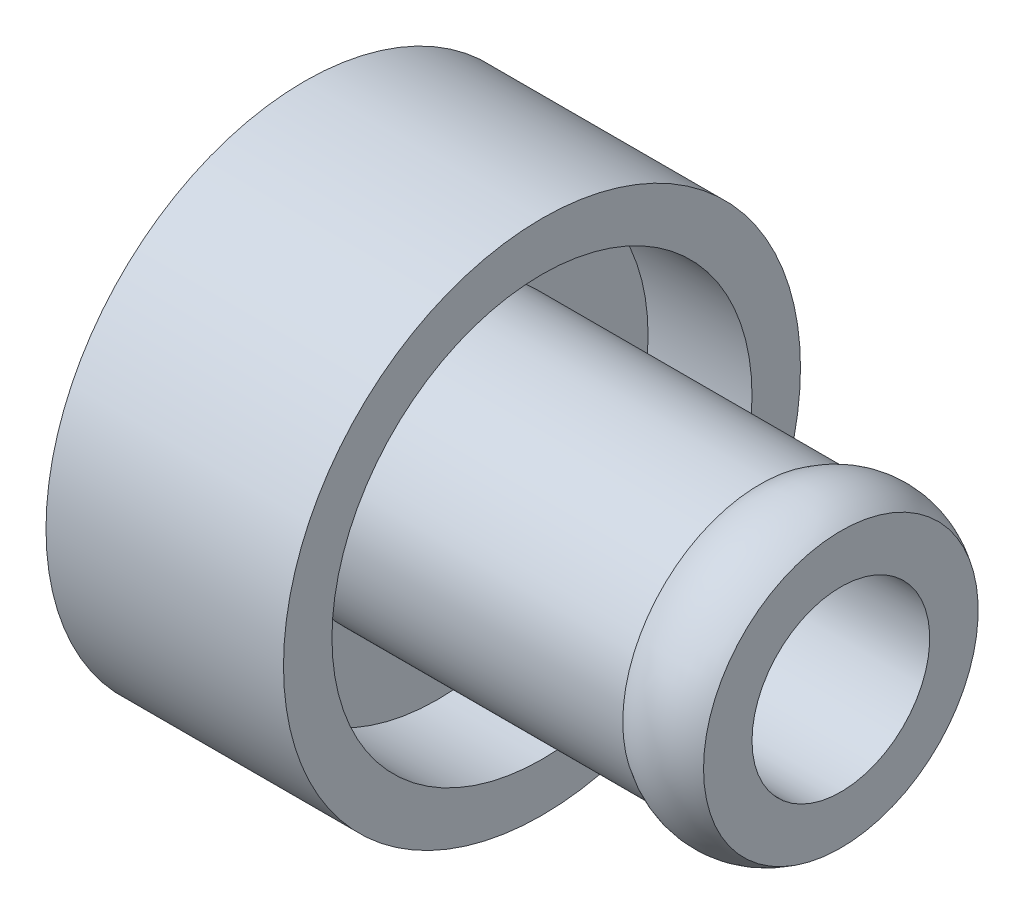
ISO-10303-21;
HEADER;
FILE_DESCRIPTION(('STEP AP214'),'2;1');
FILE_NAME('part.step','',(''),(''),'','','');
FILE_SCHEMA(('AUTOMOTIVE_DESIGN { 1 0 10303 214 1 1 1 1 }'));
ENDSEC;
DATA;
#1=APPLICATION_CONTEXT('core data for automotive mechanical design processes');
#2=APPLICATION_PROTOCOL_DEFINITION('international standard','automotive_design',2000,#1);
#3=PRODUCT_CONTEXT('',#1,'mechanical');
#4=PRODUCT('Part','Part','',(#3));
#5=PRODUCT_RELATED_PRODUCT_CATEGORY('part','',(#4));
#6=PRODUCT_DEFINITION_FORMATION('','',#4);
#7=PRODUCT_DEFINITION_CONTEXT('part definition',#1,'design');
#8=PRODUCT_DEFINITION('design','',#6,#7);
#9=PRODUCT_DEFINITION_SHAPE('','',#8);
#10=(LENGTH_UNIT() NAMED_UNIT(*) SI_UNIT(.MILLI.,.METRE.));
#11=(NAMED_UNIT(*) PLANE_ANGLE_UNIT() SI_UNIT($,.RADIAN.));
#12=(NAMED_UNIT(*) SI_UNIT($,.STERADIAN.) SOLID_ANGLE_UNIT());
#13=UNCERTAINTY_MEASURE_WITH_UNIT(LENGTH_MEASURE(1.E-05),#10,'distance_accuracy_value','');
#14=(GEOMETRIC_REPRESENTATION_CONTEXT(3) GLOBAL_UNCERTAINTY_ASSIGNED_CONTEXT((#13)) GLOBAL_UNIT_ASSIGNED_CONTEXT((#10,
#11,#12)) REPRESENTATION_CONTEXT('',''));
#15=CARTESIAN_POINT('',(0.,0.,0.));
#16=DIRECTION('',(0.,0.,1.));
#17=DIRECTION('',(1.,0.,0.));
#18=AXIS2_PLACEMENT_3D('',#15,#16,#17);
#19=CARTESIAN_POINT('',(0.,0.,0.));
#20=DIRECTION('',(-1.,0.,0.));
#21=DIRECTION('',(0.,0.,1.));
#22=AXIS2_PLACEMENT_3D('',#19,#20,#21);
#23=CYLINDRICAL_SURFACE('',#22,2.159);
#24=CARTESIAN_POINT('',(2.09995516739447,0.,0.));
#25=DIRECTION('',(-1.,0.,0.));
#26=DIRECTION('',(0.,0.,1.));
#27=AXIS2_PLACEMENT_3D('',#24,#25,#26);
#28=CIRCLE('',#27,2.159);
#29=CARTESIAN_POINT('',(2.09995516739447,0.,2.159));
#30=VERTEX_POINT('',#29);
#31=EDGE_CURVE('E94',#30,#30,#28,.T.);
#32=ORIENTED_EDGE('',*,*,#31,.F.);
#33=EDGE_LOOP('',(#32));
#34=FACE_BOUND('',#33,.T.);
#35=CARTESIAN_POINT('',(7.1628,0.,0.));
#36=DIRECTION('',(1.,0.,0.));
#37=DIRECTION('',(0.,0.,-1.));
#38=AXIS2_PLACEMENT_3D('',#35,#36,#37);
#39=CIRCLE('',#38,2.159);
#40=CARTESIAN_POINT('',(7.1628,0.,-2.159));
#41=VERTEX_POINT('',#40);
#42=EDGE_CURVE('E12',#41,#41,#39,.T.);
#43=ORIENTED_EDGE('',*,*,#42,.F.);
#44=EDGE_LOOP('',(#43));
#45=FACE_BOUND('',#44,.T.);
#46=ADVANCED_FACE('F50',(#34,#45),#23,.T.);
#47=CARTESIAN_POINT('',(0.,0.,0.));
#48=DIRECTION('',(1.,0.,0.));
#49=DIRECTION('',(0.,0.,-1.));
#50=AXIS2_PLACEMENT_3D('',#47,#48,#49);
#51=PLANE('',#50);
#52=CARTESIAN_POINT('',(0.,0.,0.));
#53=DIRECTION('',(-1.,0.,0.));
#54=DIRECTION('',(0.,0.,1.));
#55=AXIS2_PLACEMENT_3D('',#52,#53,#54);
#56=CIRCLE('',#55,1.397);
#57=CARTESIAN_POINT('',(0.,0.,1.397));
#58=VERTEX_POINT('',#57);
#59=EDGE_CURVE('E103',#58,#58,#56,.T.);
#60=ORIENTED_EDGE('',*,*,#59,.F.);
#61=EDGE_LOOP('',(#60));
#62=FACE_BOUND('',#61,.T.);
#63=CARTESIAN_POINT('',(0.,0.,0.));
#64=DIRECTION('',(-1.,0.,0.));
#65=DIRECTION('',(0.,0.,1.));
#66=AXIS2_PLACEMENT_3D('',#63,#64,#65);
#67=CIRCLE('',#66,2.159);
#68=CARTESIAN_POINT('',(0.,0.,2.159));
#69=VERTEX_POINT('',#68);
#70=EDGE_CURVE('E58',#69,#69,#67,.T.);
#71=ORIENTED_EDGE('',*,*,#70,.T.);
#72=EDGE_LOOP('',(#71));
#73=FACE_BOUND('',#72,.T.);
#74=ADVANCED_FACE('F52',(#62,#73),#51,.F.);
#75=CARTESIAN_POINT('',(0.,0.,0.));
#76=DIRECTION('',(-1.,0.,0.));
#77=DIRECTION('',(0.,0.,1.));
#78=AXIS2_PLACEMENT_3D('',#75,#76,#77);
#79=CYLINDRICAL_SURFACE('',#78,2.159);
#80=ORIENTED_EDGE('',*,*,#70,.F.);
#81=EDGE_LOOP('',(#80));
#82=FACE_BOUND('',#81,.T.);
#83=CARTESIAN_POINT('',(1.33795516739447,0.,0.));
#84=DIRECTION('',(-1.,0.,0.));
#85=DIRECTION('',(0.,0.,1.));
#86=AXIS2_PLACEMENT_3D('',#83,#84,#85);
#87=CIRCLE('',#86,2.159);
#88=CARTESIAN_POINT('',(1.33795516739447,0.,2.159));
#89=VERTEX_POINT('',#88);
#90=EDGE_CURVE('E63',#89,#89,#87,.T.);
#91=ORIENTED_EDGE('',*,*,#90,.T.);
#92=EDGE_LOOP('',(#91));
#93=FACE_BOUND('',#92,.T.);
#94=ADVANCED_FACE('F122',(#82,#93),#79,.T.);
#95=CARTESIAN_POINT('',(1.33795516739447,2.159,0.));
#96=DIRECTION('',(1.,0.,0.));
#97=DIRECTION('',(0.,0.,-1.));
#98=AXIS2_PLACEMENT_3D('',#95,#96,#97);
#99=PLANE('',#98);
#100=ORIENTED_EDGE('',*,*,#90,.F.);
#101=EDGE_LOOP('',(#100));
#102=FACE_BOUND('',#101,.T.);
#103=CARTESIAN_POINT('',(1.33795516739447,0.,0.));
#104=DIRECTION('',(-1.,0.,0.));
#105=DIRECTION('',(0.,0.,1.));
#106=AXIS2_PLACEMENT_3D('',#103,#104,#105);
#107=CIRCLE('',#106,3.302);
#108=CARTESIAN_POINT('',(1.33795516739447,0.,3.302));
#109=VERTEX_POINT('',#108);
#110=EDGE_CURVE('E68',#109,#109,#107,.T.);
#111=ORIENTED_EDGE('',*,*,#110,.T.);
#112=EDGE_LOOP('',(#111));
#113=FACE_BOUND('',#112,.T.);
#114=ADVANCED_FACE('F127',(#102,#113),#99,.F.);
#115=CARTESIAN_POINT('',(0.,0.,0.));
#116=DIRECTION('',(-1.,0.,0.));
#117=DIRECTION('',(0.,0.,1.));
#118=AXIS2_PLACEMENT_3D('',#115,#116,#117);
#119=CYLINDRICAL_SURFACE('',#118,3.302);
#120=ORIENTED_EDGE('',*,*,#110,.F.);
#121=EDGE_LOOP('',(#120));
#122=FACE_BOUND('',#121,.T.);
#123=CARTESIAN_POINT('',(0.,0.,0.));
#124=DIRECTION('',(-1.,0.,0.));
#125=DIRECTION('',(0.,0.,1.));
#126=AXIS2_PLACEMENT_3D('',#123,#124,#125);
#127=CIRCLE('',#126,3.302);
#128=CARTESIAN_POINT('',(0.,0.,3.302));
#129=VERTEX_POINT('',#128);
#130=EDGE_CURVE('E74',#129,#129,#127,.T.);
#131=ORIENTED_EDGE('',*,*,#130,.T.);
#132=EDGE_LOOP('',(#131));
#133=FACE_BOUND('',#132,.T.);
#134=ADVANCED_FACE('F156',(#122,#133),#119,.F.);
#135=CARTESIAN_POINT('',(0.,3.302,0.));
#136=DIRECTION('',(1.,0.,0.));
#137=DIRECTION('',(0.,0.,-1.));
#138=AXIS2_PLACEMENT_3D('',#135,#136,#137);
#139=PLANE('',#138);
#140=ORIENTED_EDGE('',*,*,#130,.F.);
#141=EDGE_LOOP('',(#140));
#142=FACE_BOUND('',#141,.T.);
#143=CARTESIAN_POINT('',(0.,0.,0.));
#144=DIRECTION('',(-1.,0.,0.));
#145=DIRECTION('',(0.,0.,1.));
#146=AXIS2_PLACEMENT_3D('',#143,#144,#145);
#147=CIRCLE('',#146,4.064);
#148=CARTESIAN_POINT('',(0.,0.,4.064));
#149=VERTEX_POINT('',#148);
#150=EDGE_CURVE('E78',#149,#149,#147,.T.);
#151=ORIENTED_EDGE('',*,*,#150,.T.);
#152=EDGE_LOOP('',(#151));
#153=FACE_BOUND('',#152,.T.);
#154=ADVANCED_FACE('F152',(#142,#153),#139,.F.);
#155=CARTESIAN_POINT('',(0.,0.,0.));
#156=DIRECTION('',(-1.,0.,0.));
#157=DIRECTION('',(0.,0.,1.));
#158=AXIS2_PLACEMENT_3D('',#155,#156,#157);
#159=CYLINDRICAL_SURFACE('',#158,4.064);
#160=ORIENTED_EDGE('',*,*,#150,.F.);
#161=EDGE_LOOP('',(#160));
#162=FACE_BOUND('',#161,.T.);
#163=CARTESIAN_POINT('',(3.7338,0.,0.));
#164=DIRECTION('',(-1.,0.,0.));
#165=DIRECTION('',(0.,0.,1.));
#166=AXIS2_PLACEMENT_3D('',#163,#164,#165);
#167=CIRCLE('',#166,4.064);
#168=CARTESIAN_POINT('',(3.7338,0.,4.064));
#169=VERTEX_POINT('',#168);
#170=EDGE_CURVE('E82',#169,#169,#167,.T.);
#171=ORIENTED_EDGE('',*,*,#170,.T.);
#172=EDGE_LOOP('',(#171));
#173=FACE_BOUND('',#172,.T.);
#174=ADVANCED_FACE('F148',(#162,#173),#159,.T.);
#175=CARTESIAN_POINT('',(3.7338,4.064,0.));
#176=DIRECTION('',(-1.,0.,0.));
#177=DIRECTION('',(0.,0.,1.));
#178=AXIS2_PLACEMENT_3D('',#175,#176,#177);
#179=PLANE('',#178);
#180=ORIENTED_EDGE('',*,*,#170,.F.);
#181=EDGE_LOOP('',(#180));
#182=FACE_BOUND('',#181,.T.);
#183=CARTESIAN_POINT('',(3.7338,0.,0.));
#184=DIRECTION('',(-1.,0.,0.));
#185=DIRECTION('',(0.,0.,1.));
#186=AXIS2_PLACEMENT_3D('',#183,#184,#185);
#187=CIRCLE('',#186,3.302);
#188=CARTESIAN_POINT('',(3.7338,0.,3.302));
#189=VERTEX_POINT('',#188);
#190=EDGE_CURVE('E86',#189,#189,#187,.T.);
#191=ORIENTED_EDGE('',*,*,#190,.T.);
#192=EDGE_LOOP('',(#191));
#193=FACE_BOUND('',#192,.T.);
#194=ADVANCED_FACE('F144',(#182,#193),#179,.F.);
#195=CARTESIAN_POINT('',(0.,0.,0.));
#196=DIRECTION('',(-1.,0.,0.));
#197=DIRECTION('',(0.,0.,1.));
#198=AXIS2_PLACEMENT_3D('',#195,#196,#197);
#199=CYLINDRICAL_SURFACE('',#198,3.302);
#200=ORIENTED_EDGE('',*,*,#190,.F.);
#201=EDGE_LOOP('',(#200));
#202=FACE_BOUND('',#201,.T.);
#203=CARTESIAN_POINT('',(2.09995516739447,0.,0.));
#204=DIRECTION('',(-1.,0.,0.));
#205=DIRECTION('',(0.,0.,1.));
#206=AXIS2_PLACEMENT_3D('',#203,#204,#205);
#207=CIRCLE('',#206,3.302);
#208=CARTESIAN_POINT('',(2.09995516739447,0.,3.302));
#209=VERTEX_POINT('',#208);
#210=EDGE_CURVE('E90',#209,#209,#207,.T.);
#211=ORIENTED_EDGE('',*,*,#210,.T.);
#212=EDGE_LOOP('',(#211));
#213=FACE_BOUND('',#212,.T.);
#214=ADVANCED_FACE('F140',(#202,#213),#199,.F.);
#215=CARTESIAN_POINT('',(2.09995516739447,3.302,0.));
#216=DIRECTION('',(-1.,0.,0.));
#217=DIRECTION('',(0.,0.,1.));
#218=AXIS2_PLACEMENT_3D('',#215,#216,#217);
#219=PLANE('',#218);
#220=ORIENTED_EDGE('',*,*,#210,.F.);
#221=EDGE_LOOP('',(#220));
#222=FACE_BOUND('',#221,.T.);
#223=ORIENTED_EDGE('',*,*,#31,.T.);
#224=EDGE_LOOP('',(#223));
#225=FACE_BOUND('',#224,.T.);
#226=ADVANCED_FACE('F137',(#222,#225),#219,.F.);
#227=CARTESIAN_POINT('',(8.4328,2.159,0.));
#228=DIRECTION('',(-1.,0.,0.));
#229=DIRECTION('',(0.,0.,1.));
#230=AXIS2_PLACEMENT_3D('',#227,#228,#229);
#231=PLANE('',#230);
#232=CARTESIAN_POINT('',(8.4328,0.,0.));
#233=DIRECTION('',(-1.,0.,0.));
#234=DIRECTION('',(0.,0.,1.));
#235=AXIS2_PLACEMENT_3D('',#232,#233,#234);
#236=CIRCLE('',#235,1.397);
#237=CARTESIAN_POINT('',(8.4328,0.,1.397));
#238=VERTEX_POINT('',#237);
#239=EDGE_CURVE('E102',#238,#238,#236,.T.);
#240=ORIENTED_EDGE('',*,*,#239,.T.);
#241=EDGE_LOOP('',(#240));
#242=FACE_BOUND('',#241,.T.);
#243=CARTESIAN_POINT('',(8.4328,0.,0.));
#244=DIRECTION('',(-1.,0.,0.));
#245=DIRECTION('',(0.,0.,1.));
#246=AXIS2_PLACEMENT_3D('',#243,#244,#245);
#247=CIRCLE('',#246,2.159);
#248=CARTESIAN_POINT('',(8.4328,0.,2.159));
#249=VERTEX_POINT('',#248);
#250=EDGE_CURVE('E98',#249,#249,#247,.T.);
#251=ORIENTED_EDGE('',*,*,#250,.F.);
#252=EDGE_LOOP('',(#251));
#253=FACE_BOUND('',#252,.T.);
#254=ADVANCED_FACE('F111',(#242,#253),#231,.F.);
#255=CARTESIAN_POINT('',(8.4328,0.,0.));
#256=DIRECTION('',(-1.,0.,0.));
#257=DIRECTION('',(0.,0.,1.));
#258=AXIS2_PLACEMENT_3D('',#255,#256,#257);
#259=CYLINDRICAL_SURFACE('',#258,1.397);
#260=ORIENTED_EDGE('',*,*,#239,.F.);
#261=EDGE_LOOP('',(#260));
#262=FACE_BOUND('',#261,.T.);
#263=ORIENTED_EDGE('',*,*,#59,.T.);
#264=EDGE_LOOP('',(#263));
#265=FACE_BOUND('',#264,.T.);
#266=ADVANCED_FACE('F114',(#262,#265),#259,.F.);
#267=CARTESIAN_POINT('',(7.7978,0.,0.));
#268=DIRECTION('',(-1.,0.,0.));
#269=DIRECTION('',(0.,0.,1.));
#270=AXIS2_PLACEMENT_3D('',#267,#268,#269);
#271=TOROIDAL_SURFACE('',#270,1.20847298325762,1.14312143255088);
#272=ORIENTED_EDGE('',*,*,#42,.T.);
#273=EDGE_LOOP('',(#272));
#274=FACE_BOUND('',#273,.T.);
#275=ORIENTED_EDGE('',*,*,#250,.T.);
#276=EDGE_LOOP('',(#275));
#277=FACE_BOUND('',#276,.T.);
#278=ADVANCED_FACE('F117',(#274,#277),#271,.T.);
#279=CLOSED_SHELL('',(#46,#74,#94,#114,#134,#154,#174,#194,#214,#226,#254,#266,#278));
#280=MANIFOLD_SOLID_BREP('B2',#279);
#281=ADVANCED_BREP_SHAPE_REPRESENTATION('',(#18,#280),#14);
#282=SHAPE_DEFINITION_REPRESENTATION(#9,#281);
ENDSEC;
END-ISO-10303-21;
